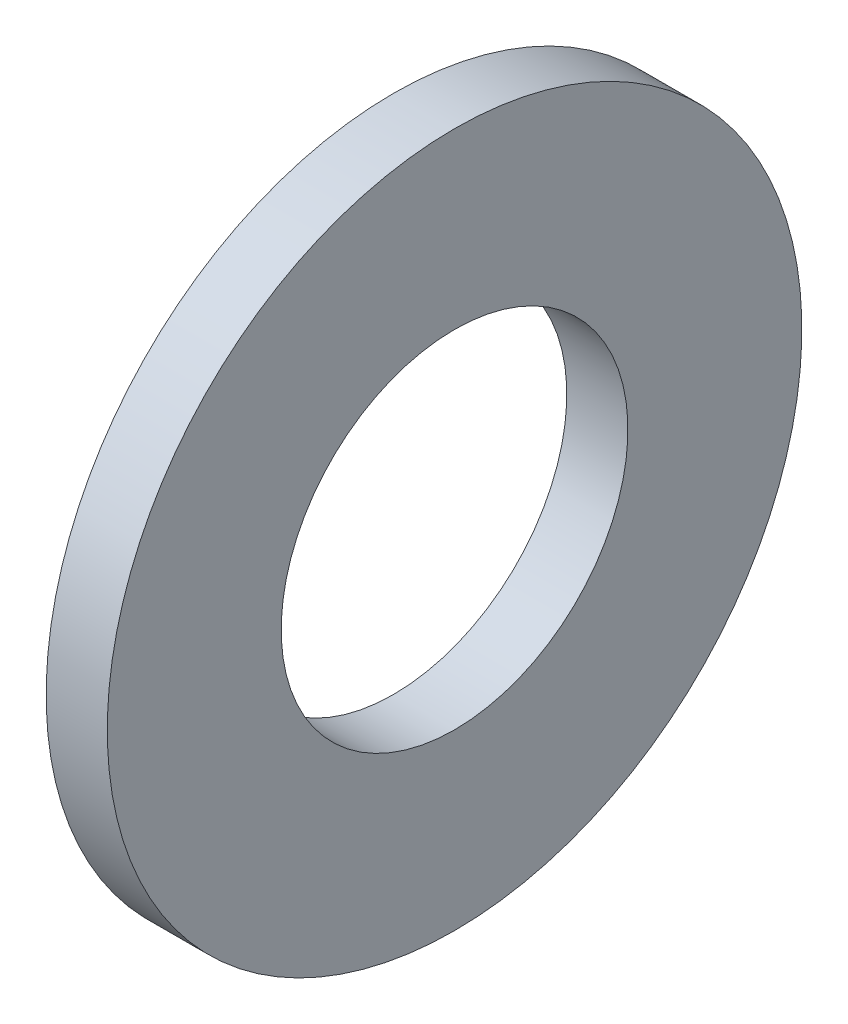
ISO-10303-21;
HEADER;
FILE_DESCRIPTION(('STEP AP214'),'2;1');
FILE_NAME('part.step','',(''),(''),'','','');
FILE_SCHEMA(('AUTOMOTIVE_DESIGN { 1 0 10303 214 1 1 1 1 }'));
ENDSEC;
DATA;
#1=APPLICATION_CONTEXT('core data for automotive mechanical design processes');
#2=APPLICATION_PROTOCOL_DEFINITION('international standard','automotive_design',2000,#1);
#3=PRODUCT_CONTEXT('',#1,'mechanical');
#4=PRODUCT('Part','Part','',(#3));
#5=PRODUCT_RELATED_PRODUCT_CATEGORY('part','',(#4));
#6=PRODUCT_DEFINITION_FORMATION('','',#4);
#7=PRODUCT_DEFINITION_CONTEXT('part definition',#1,'design');
#8=PRODUCT_DEFINITION('design','',#6,#7);
#9=PRODUCT_DEFINITION_SHAPE('','',#8);
#10=(LENGTH_UNIT() NAMED_UNIT(*) SI_UNIT(.MILLI.,.METRE.));
#11=(NAMED_UNIT(*) PLANE_ANGLE_UNIT() SI_UNIT($,.RADIAN.));
#12=(NAMED_UNIT(*) SI_UNIT($,.STERADIAN.) SOLID_ANGLE_UNIT());
#13=UNCERTAINTY_MEASURE_WITH_UNIT(LENGTH_MEASURE(1.E-05),#10,'distance_accuracy_value','');
#14=(GEOMETRIC_REPRESENTATION_CONTEXT(3) GLOBAL_UNCERTAINTY_ASSIGNED_CONTEXT((#13)) GLOBAL_UNIT_ASSIGNED_CONTEXT((#10,
#11,#12)) REPRESENTATION_CONTEXT('',''));
#15=CARTESIAN_POINT('',(0.,0.,0.));
#16=DIRECTION('',(0.,0.,1.));
#17=DIRECTION('',(1.,0.,0.));
#18=AXIS2_PLACEMENT_3D('',#15,#16,#17);
#19=CARTESIAN_POINT('',(7.45103534428E-10,0.,0.));
#20=DIRECTION('',(-1.,0.,0.));
#21=DIRECTION('',(0.,-1.,0.));
#22=AXIS2_PLACEMENT_3D('',#19,#20,#21);
#23=CYLINDRICAL_SURFACE('',#22,3.9624);
#24=CARTESIAN_POINT('',(7.45105366295462E-10,0.,0.));
#25=DIRECTION('',(-1.,0.,0.));
#26=DIRECTION('',(0.,-1.,0.));
#27=AXIS2_PLACEMENT_3D('',#24,#25,#26);
#28=CIRCLE('',#27,3.9624);
#29=CARTESIAN_POINT('',(7.45105366295462E-10,-3.9624,0.));
#30=VERTEX_POINT('',#29);
#31=EDGE_CURVE('E27',#30,#30,#28,.F.);
#32=ORIENTED_EDGE('',*,*,#31,.T.);
#33=EDGE_LOOP('',(#32));
#34=FACE_BOUND('',#33,.T.);
#35=CARTESIAN_POINT('',(-1.396999999238,0.,0.));
#36=DIRECTION('',(-1.,0.,0.));
#37=DIRECTION('',(0.,-1.,0.));
#38=AXIS2_PLACEMENT_3D('',#35,#36,#37);
#39=CIRCLE('',#38,3.9624);
#40=CARTESIAN_POINT('',(-1.396999999238,-3.9624,0.));
#41=VERTEX_POINT('',#40);
#42=EDGE_CURVE('E18',#41,#41,#39,.T.);
#43=ORIENTED_EDGE('',*,*,#42,.T.);
#44=EDGE_LOOP('',(#43));
#45=FACE_BOUND('',#44,.T.);
#46=ADVANCED_FACE('F15',(#34,#45),#23,.F.);
#47=CARTESIAN_POINT('',(-1.39700000019355,0.,0.));
#48=DIRECTION('',(1.,0.,0.));
#49=DIRECTION('',(0.,0.,-1.));
#50=AXIS2_PLACEMENT_3D('',#47,#48,#49);
#51=PLANE('',#50);
#52=ORIENTED_EDGE('',*,*,#42,.F.);
#53=EDGE_LOOP('',(#52));
#54=FACE_BOUND('',#53,.T.);
#55=CARTESIAN_POINT('',(-1.396999999238,0.,0.));
#56=DIRECTION('',(-1.,0.,0.));
#57=DIRECTION('',(0.,-1.,0.));
#58=AXIS2_PLACEMENT_3D('',#55,#56,#57);
#59=CIRCLE('',#58,7.9375);
#60=CARTESIAN_POINT('',(-1.396999999238,-7.9375,0.));
#61=VERTEX_POINT('',#60);
#62=EDGE_CURVE('E22',#61,#61,#59,.T.);
#63=ORIENTED_EDGE('',*,*,#62,.T.);
#64=EDGE_LOOP('',(#63));
#65=FACE_BOUND('',#64,.T.);
#66=ADVANCED_FACE('F36',(#54,#65),#51,.F.);
#67=CARTESIAN_POINT('',(0.,0.,0.));
#68=DIRECTION('',(-1.,0.,0.));
#69=DIRECTION('',(0.,0.,1.));
#70=AXIS2_PLACEMENT_3D('',#67,#68,#69);
#71=PLANE('',#70);
#72=ORIENTED_EDGE('',*,*,#31,.F.);
#73=EDGE_LOOP('',(#72));
#74=FACE_BOUND('',#73,.T.);
#75=CARTESIAN_POINT('',(7.45105366295462E-10,0.,0.));
#76=DIRECTION('',(-1.,0.,0.));
#77=DIRECTION('',(0.,-1.,0.));
#78=AXIS2_PLACEMENT_3D('',#75,#76,#77);
#79=CIRCLE('',#78,7.9375);
#80=CARTESIAN_POINT('',(7.45105366295462E-10,-7.9375,0.));
#81=VERTEX_POINT('',#80);
#82=EDGE_CURVE('E10',#81,#81,#79,.F.);
#83=ORIENTED_EDGE('',*,*,#82,.T.);
#84=EDGE_LOOP('',(#83));
#85=FACE_BOUND('',#84,.T.);
#86=ADVANCED_FACE('F39',(#74,#85),#71,.F.);
#87=CARTESIAN_POINT('',(7.45103534428E-10,0.,0.));
#88=DIRECTION('',(-1.,0.,0.));
#89=DIRECTION('',(0.,-1.,0.));
#90=AXIS2_PLACEMENT_3D('',#87,#88,#89);
#91=CYLINDRICAL_SURFACE('',#90,7.9375);
#92=ORIENTED_EDGE('',*,*,#82,.F.);
#93=EDGE_LOOP('',(#92));
#94=FACE_BOUND('',#93,.T.);
#95=ORIENTED_EDGE('',*,*,#62,.F.);
#96=EDGE_LOOP('',(#95));
#97=FACE_BOUND('',#96,.T.);
#98=ADVANCED_FACE('F42',(#94,#97),#91,.T.);
#99=CLOSED_SHELL('',(#46,#66,#86,#98));
#100=MANIFOLD_SOLID_BREP('B1',#99);
#101=ADVANCED_BREP_SHAPE_REPRESENTATION('',(#18,#100),#14);
#102=SHAPE_DEFINITION_REPRESENTATION(#9,#101);
ENDSEC;
END-ISO-10303-21;
